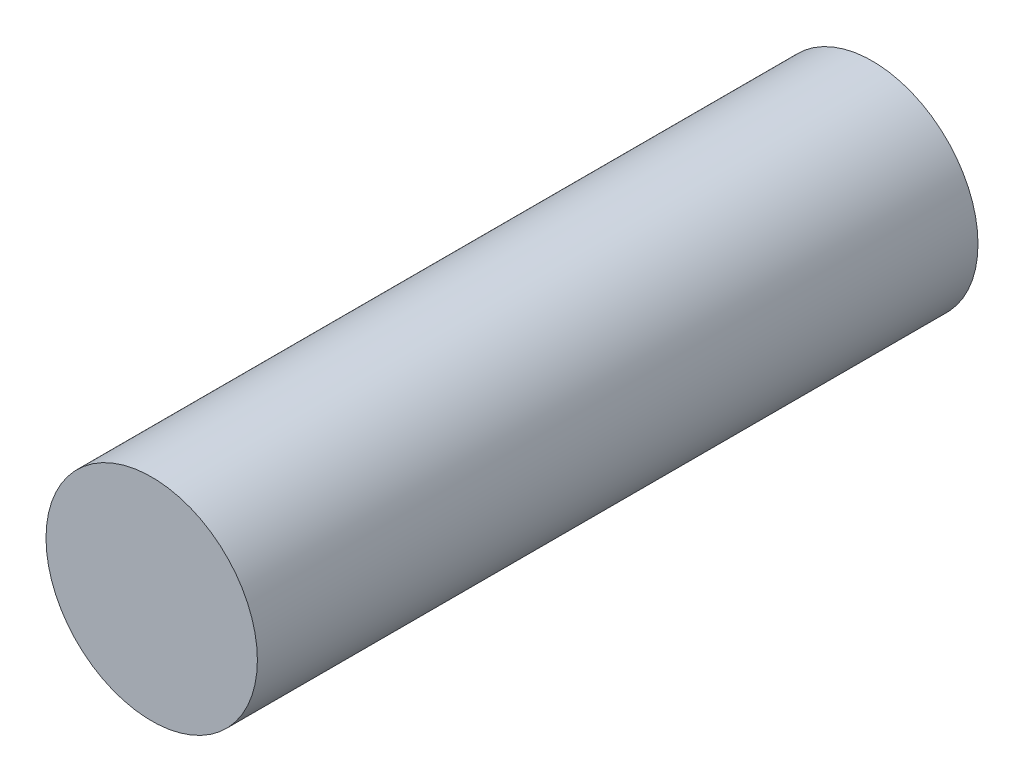
ISO-10303-21;
HEADER;
FILE_DESCRIPTION(('STEP AP214'),'2;1');
FILE_NAME('part.step','',(''),(''),'','','');
FILE_SCHEMA(('AUTOMOTIVE_DESIGN { 1 0 10303 214 1 1 1 1 }'));
ENDSEC;
DATA;
#1=APPLICATION_CONTEXT('core data for automotive mechanical design processes');
#2=APPLICATION_PROTOCOL_DEFINITION('international standard','automotive_design',2000,#1);
#3=PRODUCT_CONTEXT('',#1,'mechanical');
#4=PRODUCT('Part','Part','',(#3));
#5=PRODUCT_RELATED_PRODUCT_CATEGORY('part','',(#4));
#6=PRODUCT_DEFINITION_FORMATION('','',#4);
#7=PRODUCT_DEFINITION_CONTEXT('part definition',#1,'design');
#8=PRODUCT_DEFINITION('design','',#6,#7);
#9=PRODUCT_DEFINITION_SHAPE('','',#8);
#10=(LENGTH_UNIT() NAMED_UNIT(*) SI_UNIT(.MILLI.,.METRE.));
#11=(NAMED_UNIT(*) PLANE_ANGLE_UNIT() SI_UNIT($,.RADIAN.));
#12=(NAMED_UNIT(*) SI_UNIT($,.STERADIAN.) SOLID_ANGLE_UNIT());
#13=UNCERTAINTY_MEASURE_WITH_UNIT(LENGTH_MEASURE(1.E-05),#10,'distance_accuracy_value','');
#14=(GEOMETRIC_REPRESENTATION_CONTEXT(3) GLOBAL_UNCERTAINTY_ASSIGNED_CONTEXT((#13)) GLOBAL_UNIT_ASSIGNED_CONTEXT((#10,
#11,#12)) REPRESENTATION_CONTEXT('',''));
#15=CARTESIAN_POINT('',(0.,0.,0.));
#16=DIRECTION('',(0.,0.,1.));
#17=DIRECTION('',(1.,0.,0.));
#18=AXIS2_PLACEMENT_3D('',#15,#16,#17);
#19=CARTESIAN_POINT('',(0.,0.,15.));
#20=DIRECTION('',(0.,0.,-1.));
#21=DIRECTION('',(-1.,0.,0.));
#22=AXIS2_PLACEMENT_3D('',#19,#20,#21);
#23=CYLINDRICAL_SURFACE('',#22,2.2);
#24=CARTESIAN_POINT('',(0.,0.,15.));
#25=DIRECTION('',(0.,0.,1.));
#26=DIRECTION('',(1.,0.,0.));
#27=AXIS2_PLACEMENT_3D('',#24,#25,#26);
#28=CIRCLE('',#27,2.2);
#29=CARTESIAN_POINT('',(2.2,0.,15.));
#30=VERTEX_POINT('',#29);
#31=EDGE_CURVE('E10',#30,#30,#28,.T.);
#32=ORIENTED_EDGE('',*,*,#31,.F.);
#33=EDGE_LOOP('',(#32));
#34=FACE_BOUND('',#33,.T.);
#35=CARTESIAN_POINT('',(0.,0.,0.));
#36=DIRECTION('',(0.,0.,1.));
#37=DIRECTION('',(1.,0.,0.));
#38=AXIS2_PLACEMENT_3D('',#35,#36,#37);
#39=CIRCLE('',#38,2.2);
#40=CARTESIAN_POINT('',(2.2,0.,0.));
#41=VERTEX_POINT('',#40);
#42=EDGE_CURVE('E38',#41,#41,#39,.T.);
#43=ORIENTED_EDGE('',*,*,#42,.T.);
#44=EDGE_LOOP('',(#43));
#45=FACE_BOUND('',#44,.T.);
#46=ADVANCED_FACE('F35',(#34,#45),#23,.T.);
#47=CARTESIAN_POINT('',(0.,0.,15.));
#48=DIRECTION('',(0.,0.,1.));
#49=DIRECTION('',(1.,0.,0.));
#50=AXIS2_PLACEMENT_3D('',#47,#48,#49);
#51=PLANE('',#50);
#52=ORIENTED_EDGE('',*,*,#31,.T.);
#53=EDGE_LOOP('',(#52));
#54=FACE_BOUND('',#53,.T.);
#55=ADVANCED_FACE('F50',(#54),#51,.T.);
#56=CARTESIAN_POINT('',(0.,0.,0.));
#57=DIRECTION('',(0.,0.,1.));
#58=DIRECTION('',(1.,0.,0.));
#59=AXIS2_PLACEMENT_3D('',#56,#57,#58);
#60=PLANE('',#59);
#61=ORIENTED_EDGE('',*,*,#42,.F.);
#62=EDGE_LOOP('',(#61));
#63=FACE_BOUND('',#62,.T.);
#64=ADVANCED_FACE('F48',(#63),#60,.F.);
#65=CLOSED_SHELL('',(#46,#55,#64));
#66=MANIFOLD_SOLID_BREP('B2',#65);
#67=ADVANCED_BREP_SHAPE_REPRESENTATION('',(#18,#66),#14);
#68=SHAPE_DEFINITION_REPRESENTATION(#9,#67);
ENDSEC;
END-ISO-10303-21;
